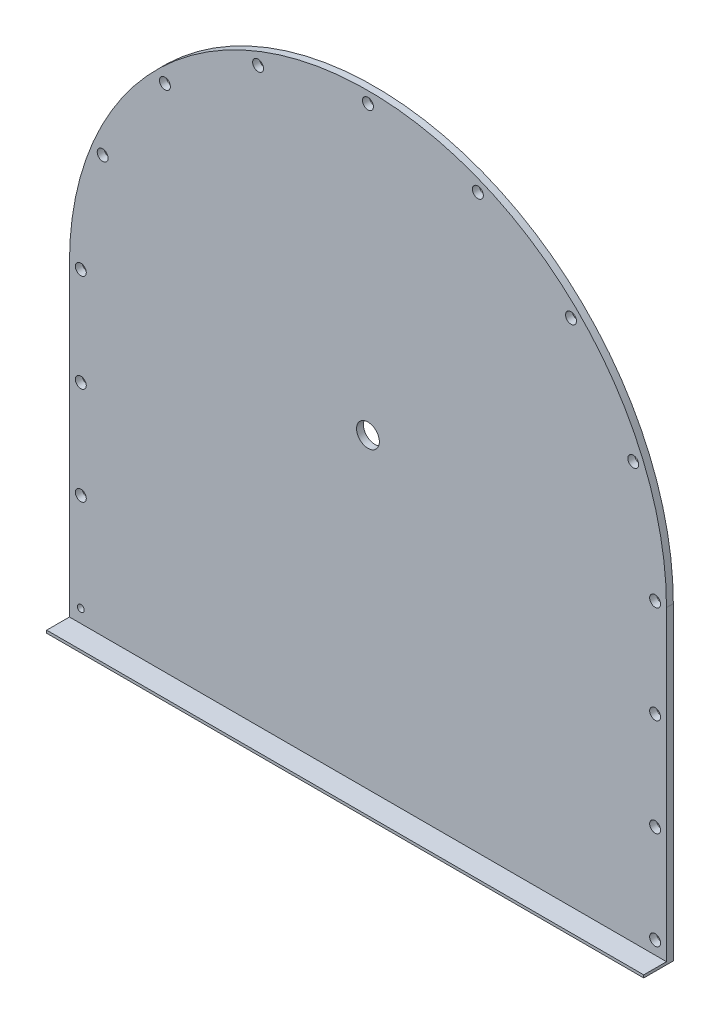
ISO-10303-21;
HEADER;
FILE_DESCRIPTION(('STEP AP214'),'2;1');
FILE_NAME('part.step','',(''),(''),'','','');
FILE_SCHEMA(('AUTOMOTIVE_DESIGN { 1 0 10303 214 1 1 1 1 }'));
ENDSEC;
DATA;
#1=APPLICATION_CONTEXT('core data for automotive mechanical design processes');
#2=APPLICATION_PROTOCOL_DEFINITION('international standard','automotive_design',2000,#1);
#3=PRODUCT_CONTEXT('',#1,'mechanical');
#4=PRODUCT('Part','Part','',(#3));
#5=PRODUCT_RELATED_PRODUCT_CATEGORY('part','',(#4));
#6=PRODUCT_DEFINITION_FORMATION('','',#4);
#7=PRODUCT_DEFINITION_CONTEXT('part definition',#1,'design');
#8=PRODUCT_DEFINITION('design','',#6,#7);
#9=PRODUCT_DEFINITION_SHAPE('','',#8);
#10=(LENGTH_UNIT() NAMED_UNIT(*) SI_UNIT(.MILLI.,.METRE.));
#11=(NAMED_UNIT(*) PLANE_ANGLE_UNIT() SI_UNIT($,.RADIAN.));
#12=(NAMED_UNIT(*) SI_UNIT($,.STERADIAN.) SOLID_ANGLE_UNIT());
#13=UNCERTAINTY_MEASURE_WITH_UNIT(LENGTH_MEASURE(1.E-05),#10,'distance_accuracy_value','');
#14=(GEOMETRIC_REPRESENTATION_CONTEXT(3) GLOBAL_UNCERTAINTY_ASSIGNED_CONTEXT((#13)) GLOBAL_UNIT_ASSIGNED_CONTEXT((#10,
#11,#12)) REPRESENTATION_CONTEXT('',''));
#15=CARTESIAN_POINT('',(0.,0.,0.));
#16=DIRECTION('',(0.,0.,1.));
#17=DIRECTION('',(1.,0.,0.));
#18=AXIS2_PLACEMENT_3D('',#15,#16,#17);
#19=CARTESIAN_POINT('',(1312.,0.,-65.));
#20=DIRECTION('',(0.,0.,1.));
#21=DIRECTION('',(1.,0.,0.));
#22=AXIS2_PLACEMENT_3D('',#19,#20,#21);
#23=PLANE('',#22);
#24=CARTESIAN_POINT('',(1287.,35.,-65.));
#25=DIRECTION('',(0.,0.,1.));
#26=DIRECTION('',(1.,0.,0.));
#27=AXIS2_PLACEMENT_3D('',#24,#25,#26);
#28=CIRCLE('',#27,12.);
#29=CARTESIAN_POINT('',(1299.,35.,-65.));
#30=VERTEX_POINT('',#29);
#31=EDGE_CURVE('E341',#30,#30,#28,.F.);
#32=ORIENTED_EDGE('',*,*,#31,.F.);
#33=EDGE_LOOP('',(#32));
#34=FACE_BOUND('',#33,.T.);
#35=CARTESIAN_POINT('',(1287.,250.,-65.));
#36=DIRECTION('',(0.,0.,1.));
#37=DIRECTION('',(1.,0.,0.));
#38=AXIS2_PLACEMENT_3D('',#35,#36,#37);
#39=CIRCLE('',#38,12.);
#40=CARTESIAN_POINT('',(1299.,250.,-65.));
#41=VERTEX_POINT('',#40);
#42=EDGE_CURVE('E335',#41,#41,#39,.F.);
#43=ORIENTED_EDGE('',*,*,#42,.F.);
#44=EDGE_LOOP('',(#43));
#45=FACE_BOUND('',#44,.T.);
#46=CARTESIAN_POINT('',(1287.,465.,-65.));
#47=DIRECTION('',(0.,0.,1.));
#48=DIRECTION('',(1.,0.,0.));
#49=AXIS2_PLACEMENT_3D('',#46,#47,#48);
#50=CIRCLE('',#49,12.);
#51=CARTESIAN_POINT('',(1299.,465.,-65.));
#52=VERTEX_POINT('',#51);
#53=EDGE_CURVE('E329',#52,#52,#50,.F.);
#54=ORIENTED_EDGE('',*,*,#53,.F.);
#55=EDGE_LOOP('',(#54));
#56=FACE_BOUND('',#55,.T.);
#57=CARTESIAN_POINT('',(1287.,680.,-65.));
#58=DIRECTION('',(0.,0.,1.));
#59=DIRECTION('',(1.,0.,0.));
#60=AXIS2_PLACEMENT_3D('',#57,#58,#59);
#61=CIRCLE('',#60,12.);
#62=CARTESIAN_POINT('',(1299.,680.,-65.));
#63=VERTEX_POINT('',#62);
#64=EDGE_CURVE('E323',#63,#63,#61,.F.);
#65=ORIENTED_EDGE('',*,*,#64,.F.);
#66=EDGE_LOOP('',(#65));
#67=FACE_BOUND('',#66,.T.);
#68=CARTESIAN_POINT('',(1238.96798501462,921.473245822368,-65.));
#69=DIRECTION('',(0.,0.,1.));
#70=DIRECTION('',(1.,0.,0.));
#71=AXIS2_PLACEMENT_3D('',#68,#69,#70);
#72=CIRCLE('',#71,12.);
#73=CARTESIAN_POINT('',(1250.96798501462,921.473245822368,-65.));
#74=VERTEX_POINT('',#73);
#75=EDGE_CURVE('E317',#74,#74,#72,.F.);
#76=ORIENTED_EDGE('',*,*,#75,.F.);
#77=EDGE_LOOP('',(#76));
#78=FACE_BOUND('',#77,.T.);
#79=CARTESIAN_POINT('',(1102.18437892871,1126.18437892871,-65.));
#80=DIRECTION('',(0.,0.,1.));
#81=DIRECTION('',(1.,0.,0.));
#82=AXIS2_PLACEMENT_3D('',#79,#80,#81);
#83=CIRCLE('',#82,12.);
#84=CARTESIAN_POINT('',(1114.18437892871,1126.18437892871,-65.));
#85=VERTEX_POINT('',#84);
#86=EDGE_CURVE('E311',#85,#85,#83,.F.);
#87=ORIENTED_EDGE('',*,*,#86,.F.);
#88=EDGE_LOOP('',(#87));
#89=FACE_BOUND('',#88,.T.);
#90=CARTESIAN_POINT('',(897.473245822374,1262.96798501462,-65.));
#91=DIRECTION('',(0.,0.,1.));
#92=DIRECTION('',(1.,0.,0.));
#93=AXIS2_PLACEMENT_3D('',#90,#91,#92);
#94=CIRCLE('',#93,12.);
#95=CARTESIAN_POINT('',(909.473245822374,1262.96798501462,-65.));
#96=VERTEX_POINT('',#95);
#97=EDGE_CURVE('E305',#96,#96,#94,.F.);
#98=ORIENTED_EDGE('',*,*,#97,.F.);
#99=EDGE_LOOP('',(#98));
#100=FACE_BOUND('',#99,.T.);
#101=CARTESIAN_POINT('',(656.000000000002,1311.,-65.));
#102=DIRECTION('',(0.,0.,1.));
#103=DIRECTION('',(1.,0.,0.));
#104=AXIS2_PLACEMENT_3D('',#101,#102,#103);
#105=CIRCLE('',#104,12.);
#106=CARTESIAN_POINT('',(668.000000000002,1311.,-65.));
#107=VERTEX_POINT('',#106);
#108=EDGE_CURVE('E299',#107,#107,#105,.F.);
#109=ORIENTED_EDGE('',*,*,#108,.F.);
#110=EDGE_LOOP('',(#109));
#111=FACE_BOUND('',#110,.T.);
#112=CARTESIAN_POINT('',(414.52675417763,1262.96798501462,-65.));
#113=DIRECTION('',(0.,0.,1.));
#114=DIRECTION('',(1.,0.,0.));
#115=AXIS2_PLACEMENT_3D('',#112,#113,#114);
#116=CIRCLE('',#115,12.);
#117=CARTESIAN_POINT('',(426.52675417763,1262.96798501462,-65.));
#118=VERTEX_POINT('',#117);
#119=EDGE_CURVE('E293',#118,#118,#116,.F.);
#120=ORIENTED_EDGE('',*,*,#119,.F.);
#121=EDGE_LOOP('',(#120));
#122=FACE_BOUND('',#121,.T.);
#123=CARTESIAN_POINT('',(209.815621071289,1126.18437892871,-65.));
#124=DIRECTION('',(0.,0.,1.));
#125=DIRECTION('',(1.,0.,0.));
#126=AXIS2_PLACEMENT_3D('',#123,#124,#125);
#127=CIRCLE('',#126,12.);
#128=CARTESIAN_POINT('',(221.815621071289,1126.18437892871,-65.));
#129=VERTEX_POINT('',#128);
#130=EDGE_CURVE('E287',#129,#129,#127,.F.);
#131=ORIENTED_EDGE('',*,*,#130,.F.);
#132=EDGE_LOOP('',(#131));
#133=FACE_BOUND('',#132,.T.);
#134=CARTESIAN_POINT('',(73.0320149853783,921.473245822372,-65.));
#135=DIRECTION('',(0.,0.,1.));
#136=DIRECTION('',(1.,0.,0.));
#137=AXIS2_PLACEMENT_3D('',#134,#135,#136);
#138=CIRCLE('',#137,12.);
#139=CARTESIAN_POINT('',(85.0320149853783,921.473245822372,-65.));
#140=VERTEX_POINT('',#139);
#141=EDGE_CURVE('E281',#140,#140,#138,.F.);
#142=ORIENTED_EDGE('',*,*,#141,.F.);
#143=EDGE_LOOP('',(#142));
#144=FACE_BOUND('',#143,.T.);
#145=CARTESIAN_POINT('',(25.0000000000001,680.,-65.));
#146=DIRECTION('',(0.,0.,1.));
#147=DIRECTION('',(1.,0.,0.));
#148=AXIS2_PLACEMENT_3D('',#145,#146,#147);
#149=CIRCLE('',#148,12.);
#150=CARTESIAN_POINT('',(37.0000000000001,680.,-65.));
#151=VERTEX_POINT('',#150);
#152=EDGE_CURVE('E275',#151,#151,#149,.F.);
#153=ORIENTED_EDGE('',*,*,#152,.F.);
#154=EDGE_LOOP('',(#153));
#155=FACE_BOUND('',#154,.T.);
#156=CARTESIAN_POINT('',(25.0000000000001,465.,-65.));
#157=DIRECTION('',(0.,0.,1.));
#158=DIRECTION('',(1.,0.,0.));
#159=AXIS2_PLACEMENT_3D('',#156,#157,#158);
#160=CIRCLE('',#159,12.);
#161=CARTESIAN_POINT('',(37.0000000000001,465.,-65.));
#162=VERTEX_POINT('',#161);
#163=EDGE_CURVE('E269',#162,#162,#160,.F.);
#164=ORIENTED_EDGE('',*,*,#163,.F.);
#165=EDGE_LOOP('',(#164));
#166=FACE_BOUND('',#165,.T.);
#167=CARTESIAN_POINT('',(25.0000000000001,250.,-65.));
#168=DIRECTION('',(0.,0.,1.));
#169=DIRECTION('',(1.,0.,0.));
#170=AXIS2_PLACEMENT_3D('',#167,#168,#169);
#171=CIRCLE('',#170,12.);
#172=CARTESIAN_POINT('',(37.0000000000001,250.,-65.));
#173=VERTEX_POINT('',#172);
#174=EDGE_CURVE('E263',#173,#173,#171,.F.);
#175=ORIENTED_EDGE('',*,*,#174,.F.);
#176=EDGE_LOOP('',(#175));
#177=FACE_BOUND('',#176,.T.);
#178=CARTESIAN_POINT('',(25.0000000000001,35.,-65.));
#179=DIRECTION('',(0.,0.,1.));
#180=DIRECTION('',(1.,0.,0.));
#181=AXIS2_PLACEMENT_3D('',#178,#179,#180);
#182=CIRCLE('',#181,7.5);
#183=CARTESIAN_POINT('',(32.5000000000001,35.,-65.));
#184=VERTEX_POINT('',#183);
#185=EDGE_CURVE('E127',#184,#184,#182,.F.);
#186=ORIENTED_EDGE('',*,*,#185,.F.);
#187=EDGE_LOOP('',(#186));
#188=FACE_BOUND('',#187,.T.);
#189=CARTESIAN_POINT('',(656.,680.,-65.));
#190=DIRECTION('',(0.,0.,1.));
#191=DIRECTION('',(1.,0.,0.));
#192=AXIS2_PLACEMENT_3D('',#189,#190,#191);
#193=CIRCLE('',#192,25.);
#194=CARTESIAN_POINT('',(681.,680.,-65.));
#195=VERTEX_POINT('',#194);
#196=EDGE_CURVE('E143',#195,#195,#193,.F.);
#197=ORIENTED_EDGE('',*,*,#196,.F.);
#198=EDGE_LOOP('',(#197));
#199=FACE_BOUND('',#198,.T.);
#200=CARTESIAN_POINT('',(656.,680.,-65.));
#201=DIRECTION('',(0.,0.,1.));
#202=DIRECTION('',(1.,0.,0.));
#203=AXIS2_PLACEMENT_3D('',#200,#201,#202);
#204=CIRCLE('',#203,656.);
#205=CARTESIAN_POINT('',(0.,680.,-65.));
#206=VERTEX_POINT('',#205);
#207=CARTESIAN_POINT('',(1312.,680.,-65.));
#208=VERTEX_POINT('',#207);
#209=EDGE_CURVE('E68',#206,#208,#204,.F.);
#210=ORIENTED_EDGE('',*,*,#209,.T.);
#211=DIRECTION('',(0.,1.,0.));
#212=VECTOR('',#211,1.);
#213=CARTESIAN_POINT('',(1312.,0.,-65.));
#214=LINE('',#213,#212);
#215=CARTESIAN_POINT('',(1312.,0.,-65.));
#216=VERTEX_POINT('',#215);
#217=EDGE_CURVE('E117',#216,#208,#214,.T.);
#218=ORIENTED_EDGE('',*,*,#217,.F.);
#219=DIRECTION('',(-1.,0.,0.));
#220=VECTOR('',#219,1.);
#221=CARTESIAN_POINT('',(1312.,0.,-65.));
#222=LINE('',#221,#220);
#223=CARTESIAN_POINT('',(0.,0.,-65.));
#224=VERTEX_POINT('',#223);
#225=EDGE_CURVE('E61',#216,#224,#222,.T.);
#226=ORIENTED_EDGE('',*,*,#225,.T.);
#227=DIRECTION('',(0.,1.,0.));
#228=VECTOR('',#227,1.);
#229=CARTESIAN_POINT('',(0.,0.,-65.));
#230=LINE('',#229,#228);
#231=EDGE_CURVE('E119',#224,#206,#230,.T.);
#232=ORIENTED_EDGE('',*,*,#231,.T.);
#233=EDGE_LOOP('',(#210,#218,#226,#232));
#234=FACE_BOUND('',#233,.T.);
#235=ADVANCED_FACE('F53',(#34,#45,#56,#67,#78,#89,#100,#111,#122,#133,#144,#155,#166,#177,#188,
#199,#234),#23,.F.);
#236=CARTESIAN_POINT('',(1312.,6.,-50.));
#237=DIRECTION('',(0.,0.,-1.));
#238=DIRECTION('',(-1.,0.,0.));
#239=AXIS2_PLACEMENT_3D('',#236,#237,#238);
#240=PLANE('',#239);
#241=CARTESIAN_POINT('',(1287.,35.,-50.));
#242=DIRECTION('',(0.,0.,1.));
#243=DIRECTION('',(1.,0.,0.));
#244=AXIS2_PLACEMENT_3D('',#241,#242,#243);
#245=CIRCLE('',#244,12.);
#246=CARTESIAN_POINT('',(1299.,35.,-50.));
#247=VERTEX_POINT('',#246);
#248=EDGE_CURVE('E344',#247,#247,#245,.T.);
#249=ORIENTED_EDGE('',*,*,#248,.F.);
#250=EDGE_LOOP('',(#249));
#251=FACE_BOUND('',#250,.T.);
#252=CARTESIAN_POINT('',(1287.,250.,-50.));
#253=DIRECTION('',(0.,0.,1.));
#254=DIRECTION('',(1.,0.,0.));
#255=AXIS2_PLACEMENT_3D('',#252,#253,#254);
#256=CIRCLE('',#255,12.);
#257=CARTESIAN_POINT('',(1299.,250.,-50.));
#258=VERTEX_POINT('',#257);
#259=EDGE_CURVE('E338',#258,#258,#256,.T.);
#260=ORIENTED_EDGE('',*,*,#259,.F.);
#261=EDGE_LOOP('',(#260));
#262=FACE_BOUND('',#261,.T.);
#263=CARTESIAN_POINT('',(1287.,465.,-50.));
#264=DIRECTION('',(0.,0.,1.));
#265=DIRECTION('',(1.,0.,0.));
#266=AXIS2_PLACEMENT_3D('',#263,#264,#265);
#267=CIRCLE('',#266,12.);
#268=CARTESIAN_POINT('',(1299.,465.,-50.));
#269=VERTEX_POINT('',#268);
#270=EDGE_CURVE('E332',#269,#269,#267,.T.);
#271=ORIENTED_EDGE('',*,*,#270,.F.);
#272=EDGE_LOOP('',(#271));
#273=FACE_BOUND('',#272,.T.);
#274=CARTESIAN_POINT('',(1287.,680.,-50.));
#275=DIRECTION('',(0.,0.,1.));
#276=DIRECTION('',(1.,0.,0.));
#277=AXIS2_PLACEMENT_3D('',#274,#275,#276);
#278=CIRCLE('',#277,12.);
#279=CARTESIAN_POINT('',(1299.,680.,-50.));
#280=VERTEX_POINT('',#279);
#281=EDGE_CURVE('E326',#280,#280,#278,.T.);
#282=ORIENTED_EDGE('',*,*,#281,.F.);
#283=EDGE_LOOP('',(#282));
#284=FACE_BOUND('',#283,.T.);
#285=CARTESIAN_POINT('',(1238.96798501462,921.473245822368,-50.));
#286=DIRECTION('',(0.,0.,1.));
#287=DIRECTION('',(1.,0.,0.));
#288=AXIS2_PLACEMENT_3D('',#285,#286,#287);
#289=CIRCLE('',#288,12.);
#290=CARTESIAN_POINT('',(1250.96798501462,921.473245822368,-50.));
#291=VERTEX_POINT('',#290);
#292=EDGE_CURVE('E320',#291,#291,#289,.T.);
#293=ORIENTED_EDGE('',*,*,#292,.F.);
#294=EDGE_LOOP('',(#293));
#295=FACE_BOUND('',#294,.T.);
#296=CARTESIAN_POINT('',(1102.18437892871,1126.18437892871,-50.));
#297=DIRECTION('',(0.,0.,1.));
#298=DIRECTION('',(1.,0.,0.));
#299=AXIS2_PLACEMENT_3D('',#296,#297,#298);
#300=CIRCLE('',#299,12.);
#301=CARTESIAN_POINT('',(1114.18437892871,1126.18437892871,-50.));
#302=VERTEX_POINT('',#301);
#303=EDGE_CURVE('E314',#302,#302,#300,.T.);
#304=ORIENTED_EDGE('',*,*,#303,.F.);
#305=EDGE_LOOP('',(#304));
#306=FACE_BOUND('',#305,.T.);
#307=CARTESIAN_POINT('',(897.473245822374,1262.96798501462,-50.));
#308=DIRECTION('',(0.,0.,1.));
#309=DIRECTION('',(1.,0.,0.));
#310=AXIS2_PLACEMENT_3D('',#307,#308,#309);
#311=CIRCLE('',#310,12.);
#312=CARTESIAN_POINT('',(909.473245822374,1262.96798501462,-50.));
#313=VERTEX_POINT('',#312);
#314=EDGE_CURVE('E308',#313,#313,#311,.T.);
#315=ORIENTED_EDGE('',*,*,#314,.F.);
#316=EDGE_LOOP('',(#315));
#317=FACE_BOUND('',#316,.T.);
#318=CARTESIAN_POINT('',(656.000000000002,1311.,-50.));
#319=DIRECTION('',(0.,0.,1.));
#320=DIRECTION('',(1.,0.,0.));
#321=AXIS2_PLACEMENT_3D('',#318,#319,#320);
#322=CIRCLE('',#321,12.);
#323=CARTESIAN_POINT('',(668.000000000002,1311.,-50.));
#324=VERTEX_POINT('',#323);
#325=EDGE_CURVE('E302',#324,#324,#322,.T.);
#326=ORIENTED_EDGE('',*,*,#325,.F.);
#327=EDGE_LOOP('',(#326));
#328=FACE_BOUND('',#327,.T.);
#329=CARTESIAN_POINT('',(414.52675417763,1262.96798501462,-50.));
#330=DIRECTION('',(0.,0.,1.));
#331=DIRECTION('',(1.,0.,0.));
#332=AXIS2_PLACEMENT_3D('',#329,#330,#331);
#333=CIRCLE('',#332,12.);
#334=CARTESIAN_POINT('',(426.52675417763,1262.96798501462,-50.));
#335=VERTEX_POINT('',#334);
#336=EDGE_CURVE('E296',#335,#335,#333,.T.);
#337=ORIENTED_EDGE('',*,*,#336,.F.);
#338=EDGE_LOOP('',(#337));
#339=FACE_BOUND('',#338,.T.);
#340=CARTESIAN_POINT('',(209.815621071289,1126.18437892871,-50.));
#341=DIRECTION('',(0.,0.,1.));
#342=DIRECTION('',(1.,0.,0.));
#343=AXIS2_PLACEMENT_3D('',#340,#341,#342);
#344=CIRCLE('',#343,12.);
#345=CARTESIAN_POINT('',(221.815621071289,1126.18437892871,-50.));
#346=VERTEX_POINT('',#345);
#347=EDGE_CURVE('E290',#346,#346,#344,.T.);
#348=ORIENTED_EDGE('',*,*,#347,.F.);
#349=EDGE_LOOP('',(#348));
#350=FACE_BOUND('',#349,.T.);
#351=CARTESIAN_POINT('',(73.0320149853783,921.473245822372,-50.));
#352=DIRECTION('',(0.,0.,1.));
#353=DIRECTION('',(1.,0.,0.));
#354=AXIS2_PLACEMENT_3D('',#351,#352,#353);
#355=CIRCLE('',#354,12.);
#356=CARTESIAN_POINT('',(85.0320149853783,921.473245822372,-50.));
#357=VERTEX_POINT('',#356);
#358=EDGE_CURVE('E284',#357,#357,#355,.T.);
#359=ORIENTED_EDGE('',*,*,#358,.F.);
#360=EDGE_LOOP('',(#359));
#361=FACE_BOUND('',#360,.T.);
#362=CARTESIAN_POINT('',(25.0000000000001,680.,-50.));
#363=DIRECTION('',(0.,0.,1.));
#364=DIRECTION('',(1.,0.,0.));
#365=AXIS2_PLACEMENT_3D('',#362,#363,#364);
#366=CIRCLE('',#365,12.);
#367=CARTESIAN_POINT('',(37.0000000000001,680.,-50.));
#368=VERTEX_POINT('',#367);
#369=EDGE_CURVE('E278',#368,#368,#366,.T.);
#370=ORIENTED_EDGE('',*,*,#369,.F.);
#371=EDGE_LOOP('',(#370));
#372=FACE_BOUND('',#371,.T.);
#373=CARTESIAN_POINT('',(25.0000000000001,465.,-50.));
#374=DIRECTION('',(0.,0.,1.));
#375=DIRECTION('',(1.,0.,0.));
#376=AXIS2_PLACEMENT_3D('',#373,#374,#375);
#377=CIRCLE('',#376,12.);
#378=CARTESIAN_POINT('',(37.0000000000001,465.,-50.));
#379=VERTEX_POINT('',#378);
#380=EDGE_CURVE('E272',#379,#379,#377,.T.);
#381=ORIENTED_EDGE('',*,*,#380,.F.);
#382=EDGE_LOOP('',(#381));
#383=FACE_BOUND('',#382,.T.);
#384=CARTESIAN_POINT('',(25.0000000000001,250.,-50.));
#385=DIRECTION('',(0.,0.,1.));
#386=DIRECTION('',(1.,0.,0.));
#387=AXIS2_PLACEMENT_3D('',#384,#385,#386);
#388=CIRCLE('',#387,12.);
#389=CARTESIAN_POINT('',(37.0000000000001,250.,-50.));
#390=VERTEX_POINT('',#389);
#391=EDGE_CURVE('E260',#390,#390,#388,.T.);
#392=ORIENTED_EDGE('',*,*,#391,.F.);
#393=EDGE_LOOP('',(#392));
#394=FACE_BOUND('',#393,.T.);
#395=CARTESIAN_POINT('',(25.0000000000001,35.,-50.));
#396=DIRECTION('',(0.,0.,1.));
#397=DIRECTION('',(1.,0.,0.));
#398=AXIS2_PLACEMENT_3D('',#395,#396,#397);
#399=CIRCLE('',#398,7.5);
#400=CARTESIAN_POINT('',(32.5000000000001,35.,-50.));
#401=VERTEX_POINT('',#400);
#402=EDGE_CURVE('E265',#401,#401,#399,.T.);
#403=ORIENTED_EDGE('',*,*,#402,.F.);
#404=EDGE_LOOP('',(#403));
#405=FACE_BOUND('',#404,.T.);
#406=CARTESIAN_POINT('',(656.,680.,-50.));
#407=DIRECTION('',(0.,0.,1.));
#408=DIRECTION('',(1.,0.,0.));
#409=AXIS2_PLACEMENT_3D('',#406,#407,#408);
#410=CIRCLE('',#409,25.);
#411=CARTESIAN_POINT('',(681.,680.,-50.));
#412=VERTEX_POINT('',#411);
#413=EDGE_CURVE('E156',#412,#412,#410,.T.);
#414=ORIENTED_EDGE('',*,*,#413,.F.);
#415=EDGE_LOOP('',(#414));
#416=FACE_BOUND('',#415,.T.);
#417=DIRECTION('',(0.,-1.,0.));
#418=VECTOR('',#417,1.);
#419=CARTESIAN_POINT('',(1312.,6.,-50.));
#420=LINE('',#419,#418);
#421=CARTESIAN_POINT('',(1312.,680.,-50.));
#422=VERTEX_POINT('',#421);
#423=CARTESIAN_POINT('',(1312.,6.,-50.));
#424=VERTEX_POINT('',#423);
#425=EDGE_CURVE('E130',#422,#424,#420,.T.);
#426=ORIENTED_EDGE('',*,*,#425,.F.);
#427=CARTESIAN_POINT('',(656.,680.,-50.));
#428=DIRECTION('',(0.,0.,1.));
#429=DIRECTION('',(1.,0.,0.));
#430=AXIS2_PLACEMENT_3D('',#427,#428,#429);
#431=CIRCLE('',#430,656.);
#432=CARTESIAN_POINT('',(0.,680.,-50.));
#433=VERTEX_POINT('',#432);
#434=EDGE_CURVE('E120',#422,#433,#431,.T.);
#435=ORIENTED_EDGE('',*,*,#434,.T.);
#436=DIRECTION('',(0.,-1.,0.));
#437=VECTOR('',#436,1.);
#438=CARTESIAN_POINT('',(0.,6.,-50.));
#439=LINE('',#438,#437);
#440=CARTESIAN_POINT('',(0.,6.,-50.));
#441=VERTEX_POINT('',#440);
#442=EDGE_CURVE('E146',#433,#441,#439,.T.);
#443=ORIENTED_EDGE('',*,*,#442,.T.);
#444=DIRECTION('',(-1.,0.,0.));
#445=VECTOR('',#444,1.);
#446=CARTESIAN_POINT('',(1312.,6.,-50.));
#447=LINE('',#446,#445);
#448=EDGE_CURVE('E150',#424,#441,#447,.T.);
#449=ORIENTED_EDGE('',*,*,#448,.F.);
#450=EDGE_LOOP('',(#426,#435,#443,#449));
#451=FACE_BOUND('',#450,.T.);
#452=ADVANCED_FACE('F177',(#251,#262,#273,#284,#295,#306,#317,#328,#339,#350,#361,#372,#383,
#394,#405,#416,#451),#240,.F.);
#453=CARTESIAN_POINT('',(1312.,0.,0.));
#454=DIRECTION('',(1.,0.,0.));
#455=DIRECTION('',(0.,0.,-1.));
#456=AXIS2_PLACEMENT_3D('',#453,#454,#455);
#457=PLANE('',#456);
#458=ORIENTED_EDGE('',*,*,#217,.T.);
#459=DIRECTION('',(0.,0.,1.));
#460=VECTOR('',#459,1.);
#461=CARTESIAN_POINT('',(1312.,680.,-65.001));
#462=LINE('',#461,#460);
#463=EDGE_CURVE('E121',#208,#422,#462,.T.);
#464=ORIENTED_EDGE('',*,*,#463,.T.);
#465=ORIENTED_EDGE('',*,*,#425,.T.);
#466=DIRECTION('',(0.,0.,1.));
#467=VECTOR('',#466,1.);
#468=CARTESIAN_POINT('',(1312.,6.,0.));
#469=LINE('',#468,#467);
#470=CARTESIAN_POINT('',(1312.,6.,0.));
#471=VERTEX_POINT('',#470);
#472=EDGE_CURVE('E77',#424,#471,#469,.T.);
#473=ORIENTED_EDGE('',*,*,#472,.T.);
#474=DIRECTION('',(0.,-1.,0.));
#475=VECTOR('',#474,1.);
#476=CARTESIAN_POINT('',(1312.,6.,0.));
#477=LINE('',#476,#475);
#478=CARTESIAN_POINT('',(1312.,0.,0.));
#479=VERTEX_POINT('',#478);
#480=EDGE_CURVE('E133',#471,#479,#477,.T.);
#481=ORIENTED_EDGE('',*,*,#480,.T.);
#482=DIRECTION('',(0.,0.,-1.));
#483=VECTOR('',#482,1.);
#484=CARTESIAN_POINT('',(1312.,0.,0.));
#485=LINE('',#484,#483);
#486=EDGE_CURVE('E105',#479,#216,#485,.T.);
#487=ORIENTED_EDGE('',*,*,#486,.T.);
#488=EDGE_LOOP('',(#458,#464,#465,#473,#481,#487));
#489=FACE_BOUND('',#488,.T.);
#490=ADVANCED_FACE('F129',(#489),#457,.T.);
#491=CARTESIAN_POINT('',(0.,0.,0.));
#492=DIRECTION('',(1.,0.,0.));
#493=DIRECTION('',(0.,0.,-1.));
#494=AXIS2_PLACEMENT_3D('',#491,#492,#493);
#495=PLANE('',#494);
#496=DIRECTION('',(0.,0.,1.));
#497=VECTOR('',#496,1.);
#498=CARTESIAN_POINT('',(0.,680.,-65.001));
#499=LINE('',#498,#497);
#500=EDGE_CURVE('E155',#206,#433,#499,.T.);
#501=ORIENTED_EDGE('',*,*,#500,.F.);
#502=ORIENTED_EDGE('',*,*,#231,.F.);
#503=DIRECTION('',(0.,0.,-1.));
#504=VECTOR('',#503,1.);
#505=CARTESIAN_POINT('',(0.,0.,0.));
#506=LINE('',#505,#504);
#507=CARTESIAN_POINT('',(0.,0.,0.));
#508=VERTEX_POINT('',#507);
#509=EDGE_CURVE('E142',#508,#224,#506,.T.);
#510=ORIENTED_EDGE('',*,*,#509,.F.);
#511=DIRECTION('',(0.,-1.,0.));
#512=VECTOR('',#511,1.);
#513=CARTESIAN_POINT('',(0.,6.,0.));
#514=LINE('',#513,#512);
#515=CARTESIAN_POINT('',(0.,6.,0.));
#516=VERTEX_POINT('',#515);
#517=EDGE_CURVE('E139',#516,#508,#514,.T.);
#518=ORIENTED_EDGE('',*,*,#517,.F.);
#519=DIRECTION('',(0.,0.,1.));
#520=VECTOR('',#519,1.);
#521=CARTESIAN_POINT('',(0.,6.,0.));
#522=LINE('',#521,#520);
#523=EDGE_CURVE('E98',#441,#516,#522,.T.);
#524=ORIENTED_EDGE('',*,*,#523,.F.);
#525=ORIENTED_EDGE('',*,*,#442,.F.);
#526=EDGE_LOOP('',(#501,#502,#510,#518,#524,#525));
#527=FACE_BOUND('',#526,.T.);
#528=ADVANCED_FACE('F152',(#527),#495,.F.);
#529=CARTESIAN_POINT('',(1312.,6.,0.));
#530=DIRECTION('',(0.,0.,-1.));
#531=DIRECTION('',(-1.,0.,0.));
#532=AXIS2_PLACEMENT_3D('',#529,#530,#531);
#533=PLANE('',#532);
#534=ORIENTED_EDGE('',*,*,#517,.T.);
#535=DIRECTION('',(-1.,0.,0.));
#536=VECTOR('',#535,1.);
#537=CARTESIAN_POINT('',(1312.,0.,0.));
#538=LINE('',#537,#536);
#539=EDGE_CURVE('E12',#479,#508,#538,.T.);
#540=ORIENTED_EDGE('',*,*,#539,.F.);
#541=ORIENTED_EDGE('',*,*,#480,.F.);
#542=DIRECTION('',(-1.,0.,0.));
#543=VECTOR('',#542,1.);
#544=CARTESIAN_POINT('',(1312.,6.,0.));
#545=LINE('',#544,#543);
#546=EDGE_CURVE('E138',#471,#516,#545,.T.);
#547=ORIENTED_EDGE('',*,*,#546,.T.);
#548=EDGE_LOOP('',(#534,#540,#541,#547));
#549=FACE_BOUND('',#548,.T.);
#550=ADVANCED_FACE('F55',(#549),#533,.F.);
#551=CARTESIAN_POINT('',(1312.,0.,0.));
#552=DIRECTION('',(0.,1.,0.));
#553=DIRECTION('',(0.,0.,1.));
#554=AXIS2_PLACEMENT_3D('',#551,#552,#553);
#555=PLANE('',#554);
#556=ORIENTED_EDGE('',*,*,#509,.T.);
#557=ORIENTED_EDGE('',*,*,#225,.F.);
#558=ORIENTED_EDGE('',*,*,#486,.F.);
#559=ORIENTED_EDGE('',*,*,#539,.T.);
#560=EDGE_LOOP('',(#556,#557,#558,#559));
#561=FACE_BOUND('',#560,.T.);
#562=ADVANCED_FACE('F166',(#561),#555,.F.);
#563=CARTESIAN_POINT('',(1312.,6.,0.));
#564=DIRECTION('',(0.,-1.,0.));
#565=DIRECTION('',(0.,0.,-1.));
#566=AXIS2_PLACEMENT_3D('',#563,#564,#565);
#567=PLANE('',#566);
#568=ORIENTED_EDGE('',*,*,#523,.T.);
#569=ORIENTED_EDGE('',*,*,#546,.F.);
#570=ORIENTED_EDGE('',*,*,#472,.F.);
#571=ORIENTED_EDGE('',*,*,#448,.T.);
#572=EDGE_LOOP('',(#568,#569,#570,#571));
#573=FACE_BOUND('',#572,.T.);
#574=ADVANCED_FACE('F168',(#573),#567,.F.);
#575=CARTESIAN_POINT('',(656.,680.,-65.001));
#576=DIRECTION('',(0.,0.,1.));
#577=DIRECTION('',(1.,0.,0.));
#578=AXIS2_PLACEMENT_3D('',#575,#576,#577);
#579=CYLINDRICAL_SURFACE('',#578,25.);
#580=ORIENTED_EDGE('',*,*,#413,.T.);
#581=EDGE_LOOP('',(#580));
#582=FACE_BOUND('',#581,.T.);
#583=ORIENTED_EDGE('',*,*,#196,.T.);
#584=EDGE_LOOP('',(#583));
#585=FACE_BOUND('',#584,.T.);
#586=ADVANCED_FACE('F173',(#582,#585),#579,.F.);
#587=CARTESIAN_POINT('',(656.,680.,-65.001));
#588=DIRECTION('',(0.,0.,1.));
#589=DIRECTION('',(1.,0.,0.));
#590=AXIS2_PLACEMENT_3D('',#587,#588,#589);
#591=CYLINDRICAL_SURFACE('',#590,656.);
#592=ORIENTED_EDGE('',*,*,#500,.T.);
#593=ORIENTED_EDGE('',*,*,#434,.F.);
#594=ORIENTED_EDGE('',*,*,#463,.F.);
#595=ORIENTED_EDGE('',*,*,#209,.F.);
#596=EDGE_LOOP('',(#592,#593,#594,#595));
#597=FACE_BOUND('',#596,.T.);
#598=ADVANCED_FACE('F124',(#597),#591,.T.);
#599=CARTESIAN_POINT('',(25.0000000000001,35.,-65.001));
#600=DIRECTION('',(0.,0.,1.));
#601=DIRECTION('',(1.,0.,0.));
#602=AXIS2_PLACEMENT_3D('',#599,#600,#601);
#603=CYLINDRICAL_SURFACE('',#602,7.5);
#604=ORIENTED_EDGE('',*,*,#402,.T.);
#605=EDGE_LOOP('',(#604));
#606=FACE_BOUND('',#605,.T.);
#607=ORIENTED_EDGE('',*,*,#185,.T.);
#608=EDGE_LOOP('',(#607));
#609=FACE_BOUND('',#608,.T.);
#610=ADVANCED_FACE('F196',(#606,#609),#603,.F.);
#611=CARTESIAN_POINT('',(25.0000000000001,250.,-65.001));
#612=DIRECTION('',(0.,0.,1.));
#613=DIRECTION('',(1.,0.,0.));
#614=AXIS2_PLACEMENT_3D('',#611,#612,#613);
#615=CYLINDRICAL_SURFACE('',#614,12.);
#616=ORIENTED_EDGE('',*,*,#391,.T.);
#617=EDGE_LOOP('',(#616));
#618=FACE_BOUND('',#617,.T.);
#619=ORIENTED_EDGE('',*,*,#174,.T.);
#620=EDGE_LOOP('',(#619));
#621=FACE_BOUND('',#620,.T.);
#622=ADVANCED_FACE('F199',(#618,#621),#615,.F.);
#623=CARTESIAN_POINT('',(25.0000000000001,465.,-65.001));
#624=DIRECTION('',(0.,0.,1.));
#625=DIRECTION('',(1.,0.,0.));
#626=AXIS2_PLACEMENT_3D('',#623,#624,#625);
#627=CYLINDRICAL_SURFACE('',#626,12.);
#628=ORIENTED_EDGE('',*,*,#380,.T.);
#629=EDGE_LOOP('',(#628));
#630=FACE_BOUND('',#629,.T.);
#631=ORIENTED_EDGE('',*,*,#163,.T.);
#632=EDGE_LOOP('',(#631));
#633=FACE_BOUND('',#632,.T.);
#634=ADVANCED_FACE('F248',(#630,#633),#627,.F.);
#635=CARTESIAN_POINT('',(25.0000000000001,680.,-65.001));
#636=DIRECTION('',(0.,0.,1.));
#637=DIRECTION('',(1.,0.,0.));
#638=AXIS2_PLACEMENT_3D('',#635,#636,#637);
#639=CYLINDRICAL_SURFACE('',#638,12.);
#640=ORIENTED_EDGE('',*,*,#369,.T.);
#641=EDGE_LOOP('',(#640));
#642=FACE_BOUND('',#641,.T.);
#643=ORIENTED_EDGE('',*,*,#152,.T.);
#644=EDGE_LOOP('',(#643));
#645=FACE_BOUND('',#644,.T.);
#646=ADVANCED_FACE('F244',(#642,#645),#639,.F.);
#647=CARTESIAN_POINT('',(73.0320149853783,921.473245822372,-65.001));
#648=DIRECTION('',(0.,0.,1.));
#649=DIRECTION('',(1.,0.,0.));
#650=AXIS2_PLACEMENT_3D('',#647,#648,#649);
#651=CYLINDRICAL_SURFACE('',#650,12.);
#652=ORIENTED_EDGE('',*,*,#358,.T.);
#653=EDGE_LOOP('',(#652));
#654=FACE_BOUND('',#653,.T.);
#655=ORIENTED_EDGE('',*,*,#141,.T.);
#656=EDGE_LOOP('',(#655));
#657=FACE_BOUND('',#656,.T.);
#658=ADVANCED_FACE('F240',(#654,#657),#651,.F.);
#659=CARTESIAN_POINT('',(209.815621071289,1126.18437892871,-65.001));
#660=DIRECTION('',(0.,0.,1.));
#661=DIRECTION('',(1.,0.,0.));
#662=AXIS2_PLACEMENT_3D('',#659,#660,#661);
#663=CYLINDRICAL_SURFACE('',#662,12.);
#664=ORIENTED_EDGE('',*,*,#347,.T.);
#665=EDGE_LOOP('',(#664));
#666=FACE_BOUND('',#665,.T.);
#667=ORIENTED_EDGE('',*,*,#130,.T.);
#668=EDGE_LOOP('',(#667));
#669=FACE_BOUND('',#668,.T.);
#670=ADVANCED_FACE('F236',(#666,#669),#663,.F.);
#671=CARTESIAN_POINT('',(414.52675417763,1262.96798501462,-65.001));
#672=DIRECTION('',(0.,0.,1.));
#673=DIRECTION('',(1.,0.,0.));
#674=AXIS2_PLACEMENT_3D('',#671,#672,#673);
#675=CYLINDRICAL_SURFACE('',#674,12.);
#676=ORIENTED_EDGE('',*,*,#336,.T.);
#677=EDGE_LOOP('',(#676));
#678=FACE_BOUND('',#677,.T.);
#679=ORIENTED_EDGE('',*,*,#119,.T.);
#680=EDGE_LOOP('',(#679));
#681=FACE_BOUND('',#680,.T.);
#682=ADVANCED_FACE('F232',(#678,#681),#675,.F.);
#683=CARTESIAN_POINT('',(656.000000000002,1311.,-65.001));
#684=DIRECTION('',(0.,0.,1.));
#685=DIRECTION('',(1.,0.,0.));
#686=AXIS2_PLACEMENT_3D('',#683,#684,#685);
#687=CYLINDRICAL_SURFACE('',#686,12.);
#688=ORIENTED_EDGE('',*,*,#325,.T.);
#689=EDGE_LOOP('',(#688));
#690=FACE_BOUND('',#689,.T.);
#691=ORIENTED_EDGE('',*,*,#108,.T.);
#692=EDGE_LOOP('',(#691));
#693=FACE_BOUND('',#692,.T.);
#694=ADVANCED_FACE('F228',(#690,#693),#687,.F.);
#695=CARTESIAN_POINT('',(897.473245822374,1262.96798501462,-65.001));
#696=DIRECTION('',(0.,0.,1.));
#697=DIRECTION('',(1.,0.,0.));
#698=AXIS2_PLACEMENT_3D('',#695,#696,#697);
#699=CYLINDRICAL_SURFACE('',#698,12.);
#700=ORIENTED_EDGE('',*,*,#314,.T.);
#701=EDGE_LOOP('',(#700));
#702=FACE_BOUND('',#701,.T.);
#703=ORIENTED_EDGE('',*,*,#97,.T.);
#704=EDGE_LOOP('',(#703));
#705=FACE_BOUND('',#704,.T.);
#706=ADVANCED_FACE('F224',(#702,#705),#699,.F.);
#707=CARTESIAN_POINT('',(1102.18437892871,1126.18437892871,-65.001));
#708=DIRECTION('',(0.,0.,1.));
#709=DIRECTION('',(1.,0.,0.));
#710=AXIS2_PLACEMENT_3D('',#707,#708,#709);
#711=CYLINDRICAL_SURFACE('',#710,12.);
#712=ORIENTED_EDGE('',*,*,#303,.T.);
#713=EDGE_LOOP('',(#712));
#714=FACE_BOUND('',#713,.T.);
#715=ORIENTED_EDGE('',*,*,#86,.T.);
#716=EDGE_LOOP('',(#715));
#717=FACE_BOUND('',#716,.T.);
#718=ADVANCED_FACE('F220',(#714,#717),#711,.F.);
#719=CARTESIAN_POINT('',(1238.96798501462,921.473245822368,-65.001));
#720=DIRECTION('',(0.,0.,1.));
#721=DIRECTION('',(1.,0.,0.));
#722=AXIS2_PLACEMENT_3D('',#719,#720,#721);
#723=CYLINDRICAL_SURFACE('',#722,12.);
#724=ORIENTED_EDGE('',*,*,#292,.T.);
#725=EDGE_LOOP('',(#724));
#726=FACE_BOUND('',#725,.T.);
#727=ORIENTED_EDGE('',*,*,#75,.T.);
#728=EDGE_LOOP('',(#727));
#729=FACE_BOUND('',#728,.T.);
#730=ADVANCED_FACE('F216',(#726,#729),#723,.F.);
#731=CARTESIAN_POINT('',(1287.,680.,-65.001));
#732=DIRECTION('',(0.,0.,1.));
#733=DIRECTION('',(1.,0.,0.));
#734=AXIS2_PLACEMENT_3D('',#731,#732,#733);
#735=CYLINDRICAL_SURFACE('',#734,12.);
#736=ORIENTED_EDGE('',*,*,#281,.T.);
#737=EDGE_LOOP('',(#736));
#738=FACE_BOUND('',#737,.T.);
#739=ORIENTED_EDGE('',*,*,#64,.T.);
#740=EDGE_LOOP('',(#739));
#741=FACE_BOUND('',#740,.T.);
#742=ADVANCED_FACE('F212',(#738,#741),#735,.F.);
#743=CARTESIAN_POINT('',(1287.,465.,-65.001));
#744=DIRECTION('',(0.,0.,1.));
#745=DIRECTION('',(1.,0.,0.));
#746=AXIS2_PLACEMENT_3D('',#743,#744,#745);
#747=CYLINDRICAL_SURFACE('',#746,12.);
#748=ORIENTED_EDGE('',*,*,#270,.T.);
#749=EDGE_LOOP('',(#748));
#750=FACE_BOUND('',#749,.T.);
#751=ORIENTED_EDGE('',*,*,#53,.T.);
#752=EDGE_LOOP('',(#751));
#753=FACE_BOUND('',#752,.T.);
#754=ADVANCED_FACE('F208',(#750,#753),#747,.F.);
#755=CARTESIAN_POINT('',(1287.,250.,-65.001));
#756=DIRECTION('',(0.,0.,1.));
#757=DIRECTION('',(1.,0.,0.));
#758=AXIS2_PLACEMENT_3D('',#755,#756,#757);
#759=CYLINDRICAL_SURFACE('',#758,12.);
#760=ORIENTED_EDGE('',*,*,#259,.T.);
#761=EDGE_LOOP('',(#760));
#762=FACE_BOUND('',#761,.T.);
#763=ORIENTED_EDGE('',*,*,#42,.T.);
#764=EDGE_LOOP('',(#763));
#765=FACE_BOUND('',#764,.T.);
#766=ADVANCED_FACE('F204',(#762,#765),#759,.F.);
#767=CARTESIAN_POINT('',(1287.,35.,-65.001));
#768=DIRECTION('',(0.,0.,1.));
#769=DIRECTION('',(1.,0.,0.));
#770=AXIS2_PLACEMENT_3D('',#767,#768,#769);
#771=CYLINDRICAL_SURFACE('',#770,12.);
#772=ORIENTED_EDGE('',*,*,#248,.T.);
#773=EDGE_LOOP('',(#772));
#774=FACE_BOUND('',#773,.T.);
#775=ORIENTED_EDGE('',*,*,#31,.T.);
#776=EDGE_LOOP('',(#775));
#777=FACE_BOUND('',#776,.T.);
#778=ADVANCED_FACE('F201',(#774,#777),#771,.F.);
#779=CLOSED_SHELL('',(#235,#452,#490,#528,#550,#562,#574,#586,#598,#610,#622,#634,#646,#658,
#670,#682,#694,#706,#718,#730,#742,#754,#766,#778));
#780=MANIFOLD_SOLID_BREP('B2',#779);
#781=ADVANCED_BREP_SHAPE_REPRESENTATION('',(#18,#780),#14);
#782=SHAPE_DEFINITION_REPRESENTATION(#9,#781);
ENDSEC;
END-ISO-10303-21;
